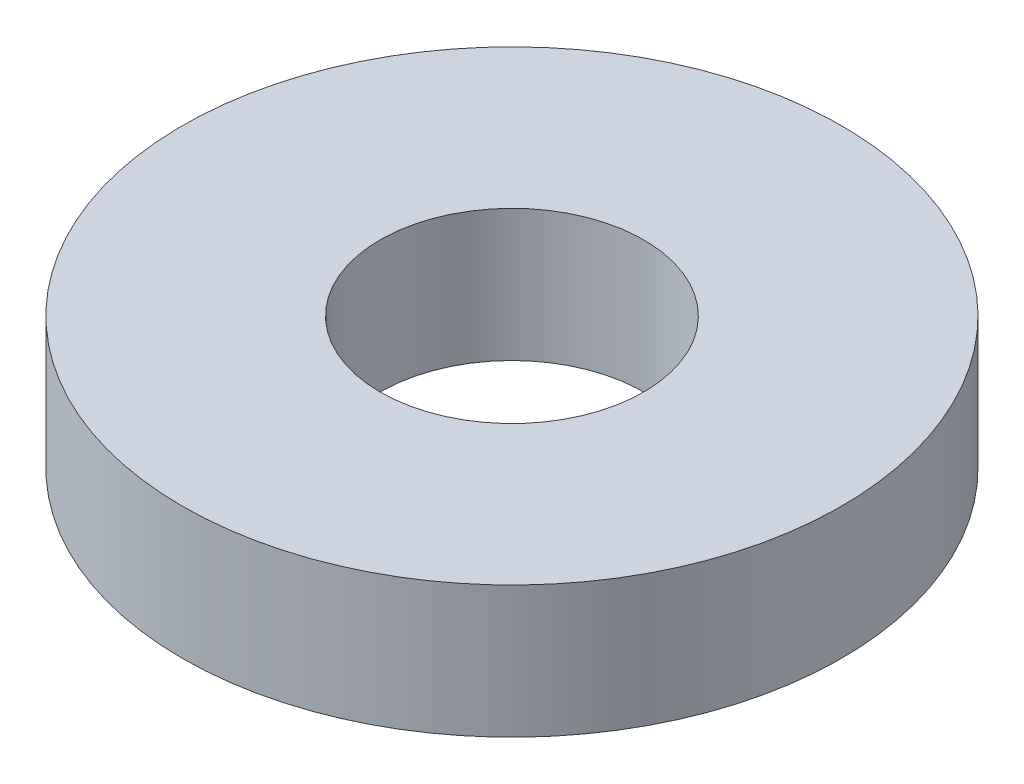
ISO-10303-21;
HEADER;
FILE_DESCRIPTION(('STEP AP214'),'2;1');
FILE_NAME('part.step','',(''),(''),'','','');
FILE_SCHEMA(('AUTOMOTIVE_DESIGN { 1 0 10303 214 1 1 1 1 }'));
ENDSEC;
DATA;
#1=APPLICATION_CONTEXT('core data for automotive mechanical design processes');
#2=APPLICATION_PROTOCOL_DEFINITION('international standard','automotive_design',2000,#1);
#3=PRODUCT_CONTEXT('',#1,'mechanical');
#4=PRODUCT('Part','Part','',(#3));
#5=PRODUCT_RELATED_PRODUCT_CATEGORY('part','',(#4));
#6=PRODUCT_DEFINITION_FORMATION('','',#4);
#7=PRODUCT_DEFINITION_CONTEXT('part definition',#1,'design');
#8=PRODUCT_DEFINITION('design','',#6,#7);
#9=PRODUCT_DEFINITION_SHAPE('','',#8);
#10=(LENGTH_UNIT() NAMED_UNIT(*) SI_UNIT(.MILLI.,.METRE.));
#11=(NAMED_UNIT(*) PLANE_ANGLE_UNIT() SI_UNIT($,.RADIAN.));
#12=(NAMED_UNIT(*) SI_UNIT($,.STERADIAN.) SOLID_ANGLE_UNIT());
#13=UNCERTAINTY_MEASURE_WITH_UNIT(LENGTH_MEASURE(1.E-05),#10,'distance_accuracy_value','');
#14=(GEOMETRIC_REPRESENTATION_CONTEXT(3) GLOBAL_UNCERTAINTY_ASSIGNED_CONTEXT((#13)) GLOBAL_UNIT_ASSIGNED_CONTEXT((#10,
#11,#12)) REPRESENTATION_CONTEXT('',''));
#15=CARTESIAN_POINT('',(0.,0.,0.));
#16=DIRECTION('',(0.,0.,1.));
#17=DIRECTION('',(1.,0.,0.));
#18=AXIS2_PLACEMENT_3D('',#15,#16,#17);
#19=CARTESIAN_POINT('',(0.,5.,0.));
#20=DIRECTION('',(0.,1.,0.));
#21=DIRECTION('',(0.,0.,1.));
#22=AXIS2_PLACEMENT_3D('',#19,#20,#21);
#23=PLANE('',#22);
#24=CARTESIAN_POINT('',(0.,5.,0.));
#25=DIRECTION('',(0.,1.,0.));
#26=DIRECTION('',(0.,0.,1.));
#27=AXIS2_PLACEMENT_3D('',#24,#25,#26);
#28=CIRCLE('',#27,12.5);
#29=CARTESIAN_POINT('',(0.,5.,12.5));
#30=VERTEX_POINT('',#29);
#31=EDGE_CURVE('E10',#30,#30,#28,.T.);
#32=ORIENTED_EDGE('',*,*,#31,.T.);
#33=EDGE_LOOP('',(#32));
#34=FACE_BOUND('',#33,.T.);
#35=CARTESIAN_POINT('',(0.,5.,0.));
#36=DIRECTION('',(0.,1.,0.));
#37=DIRECTION('',(0.,0.,1.));
#38=AXIS2_PLACEMENT_3D('',#35,#36,#37);
#39=CIRCLE('',#38,5.);
#40=CARTESIAN_POINT('',(0.,5.,5.));
#41=VERTEX_POINT('',#40);
#42=EDGE_CURVE('E50',#41,#41,#39,.T.);
#43=ORIENTED_EDGE('',*,*,#42,.F.);
#44=EDGE_LOOP('',(#43));
#45=FACE_BOUND('',#44,.T.);
#46=ADVANCED_FACE('F37',(#34,#45),#23,.T.);
#47=CARTESIAN_POINT('',(0.,0.,0.));
#48=DIRECTION('',(0.,1.,0.));
#49=DIRECTION('',(0.,0.,1.));
#50=AXIS2_PLACEMENT_3D('',#47,#48,#49);
#51=PLANE('',#50);
#52=CARTESIAN_POINT('',(0.,0.,0.));
#53=DIRECTION('',(0.,1.,0.));
#54=DIRECTION('',(0.,0.,1.));
#55=AXIS2_PLACEMENT_3D('',#52,#53,#54);
#56=CIRCLE('',#55,12.5);
#57=CARTESIAN_POINT('',(0.,0.,12.5));
#58=VERTEX_POINT('',#57);
#59=EDGE_CURVE('E41',#58,#58,#56,.T.);
#60=ORIENTED_EDGE('',*,*,#59,.F.);
#61=EDGE_LOOP('',(#60));
#62=FACE_BOUND('',#61,.T.);
#63=CARTESIAN_POINT('',(0.,0.,0.));
#64=DIRECTION('',(0.,1.,0.));
#65=DIRECTION('',(0.,0.,1.));
#66=AXIS2_PLACEMENT_3D('',#63,#64,#65);
#67=CIRCLE('',#66,5.);
#68=CARTESIAN_POINT('',(0.,0.,5.));
#69=VERTEX_POINT('',#68);
#70=EDGE_CURVE('E52',#69,#69,#67,.T.);
#71=ORIENTED_EDGE('',*,*,#70,.T.);
#72=EDGE_LOOP('',(#71));
#73=FACE_BOUND('',#72,.T.);
#74=ADVANCED_FACE('F64',(#62,#73),#51,.F.);
#75=CARTESIAN_POINT('',(0.,5.,0.));
#76=DIRECTION('',(0.,-1.,0.));
#77=DIRECTION('',(0.,0.,-1.));
#78=AXIS2_PLACEMENT_3D('',#75,#76,#77);
#79=CYLINDRICAL_SURFACE('',#78,12.5);
#80=ORIENTED_EDGE('',*,*,#31,.F.);
#81=EDGE_LOOP('',(#80));
#82=FACE_BOUND('',#81,.T.);
#83=ORIENTED_EDGE('',*,*,#59,.T.);
#84=EDGE_LOOP('',(#83));
#85=FACE_BOUND('',#84,.T.);
#86=ADVANCED_FACE('F39',(#82,#85),#79,.T.);
#87=CARTESIAN_POINT('',(0.,5.,0.));
#88=DIRECTION('',(0.,-1.,0.));
#89=DIRECTION('',(0.,0.,-1.));
#90=AXIS2_PLACEMENT_3D('',#87,#88,#89);
#91=CYLINDRICAL_SURFACE('',#90,5.);
#92=ORIENTED_EDGE('',*,*,#42,.T.);
#93=EDGE_LOOP('',(#92));
#94=FACE_BOUND('',#93,.T.);
#95=ORIENTED_EDGE('',*,*,#70,.F.);
#96=EDGE_LOOP('',(#95));
#97=FACE_BOUND('',#96,.T.);
#98=ADVANCED_FACE('F60',(#94,#97),#91,.F.);
#99=CLOSED_SHELL('',(#46,#74,#86,#98));
#100=MANIFOLD_SOLID_BREP('B2',#99);
#101=ADVANCED_BREP_SHAPE_REPRESENTATION('',(#18,#100),#14);
#102=SHAPE_DEFINITION_REPRESENTATION(#9,#101);
ENDSEC;
END-ISO-10303-21;
